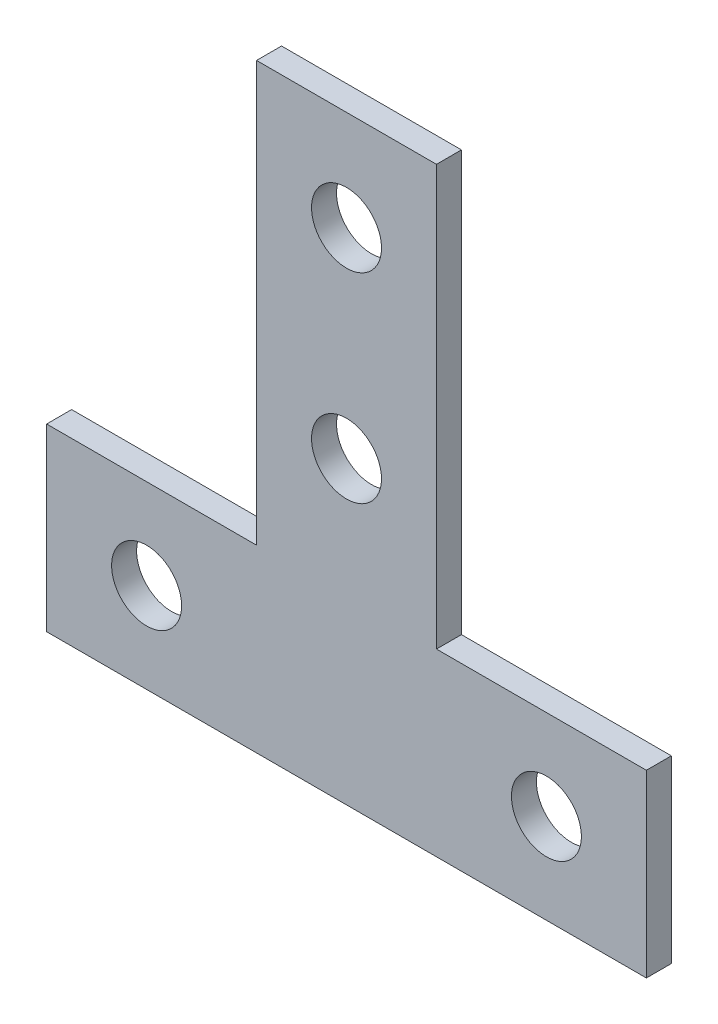
ISO-10303-21;
HEADER;
FILE_DESCRIPTION(('STEP AP214'),'2;1');
FILE_NAME('part.step','',(''),(''),'','','');
FILE_SCHEMA(('AUTOMOTIVE_DESIGN { 1 0 10303 214 1 1 1 1 }'));
ENDSEC;
DATA;
#1=APPLICATION_CONTEXT('core data for automotive mechanical design processes');
#2=APPLICATION_PROTOCOL_DEFINITION('international standard','automotive_design',2000,#1);
#3=PRODUCT_CONTEXT('',#1,'mechanical');
#4=PRODUCT('Part','Part','',(#3));
#5=PRODUCT_RELATED_PRODUCT_CATEGORY('part','',(#4));
#6=PRODUCT_DEFINITION_FORMATION('','',#4);
#7=PRODUCT_DEFINITION_CONTEXT('part definition',#1,'design');
#8=PRODUCT_DEFINITION('design','',#6,#7);
#9=PRODUCT_DEFINITION_SHAPE('','',#8);
#10=(LENGTH_UNIT() NAMED_UNIT(*) SI_UNIT(.MILLI.,.METRE.));
#11=(NAMED_UNIT(*) PLANE_ANGLE_UNIT() SI_UNIT($,.RADIAN.));
#12=(NAMED_UNIT(*) SI_UNIT($,.STERADIAN.) SOLID_ANGLE_UNIT());
#13=UNCERTAINTY_MEASURE_WITH_UNIT(LENGTH_MEASURE(1.E-05),#10,'distance_accuracy_value','');
#14=(GEOMETRIC_REPRESENTATION_CONTEXT(3) GLOBAL_UNCERTAINTY_ASSIGNED_CONTEXT((#13)) GLOBAL_UNIT_ASSIGNED_CONTEXT((#10,
#11,#12)) REPRESENTATION_CONTEXT('',''));
#15=CARTESIAN_POINT('',(0.,0.,0.));
#16=DIRECTION('',(0.,0.,1.));
#17=DIRECTION('',(1.,0.,0.));
#18=AXIS2_PLACEMENT_3D('',#15,#16,#17);
#19=CARTESIAN_POINT('',(0.,0.,2.5));
#20=DIRECTION('',(0.,0.,1.));
#21=DIRECTION('',(1.,0.,0.));
#22=AXIS2_PLACEMENT_3D('',#19,#20,#21);
#23=PLANE('',#22);
#24=CARTESIAN_POINT('',(-20.,9.,2.5));
#25=DIRECTION('',(0.,0.,1.));
#26=DIRECTION('',(1.,0.,0.));
#27=AXIS2_PLACEMENT_3D('',#24,#25,#26);
#28=CIRCLE('',#27,3.5);
#29=CARTESIAN_POINT('',(-16.5,9.,2.5));
#30=VERTEX_POINT('',#29);
#31=EDGE_CURVE('E189',#30,#30,#28,.T.);
#32=ORIENTED_EDGE('',*,*,#31,.F.);
#33=EDGE_LOOP('',(#32));
#34=FACE_BOUND('',#33,.T.);
#35=CARTESIAN_POINT('',(0.,50.,2.5));
#36=DIRECTION('',(0.,0.,1.));
#37=DIRECTION('',(1.,0.,0.));
#38=AXIS2_PLACEMENT_3D('',#35,#36,#37);
#39=CIRCLE('',#38,3.5);
#40=CARTESIAN_POINT('',(3.5,50.,2.5));
#41=VERTEX_POINT('',#40);
#42=EDGE_CURVE('E135',#41,#41,#39,.T.);
#43=ORIENTED_EDGE('',*,*,#42,.F.);
#44=EDGE_LOOP('',(#43));
#45=FACE_BOUND('',#44,.T.);
#46=DIRECTION('',(0.,1.,0.));
#47=VECTOR('',#46,1.);
#48=CARTESIAN_POINT('',(30.,18.,2.5));
#49=LINE('',#48,#47);
#50=CARTESIAN_POINT('',(30.,0.,2.5));
#51=VERTEX_POINT('',#50);
#52=CARTESIAN_POINT('',(30.,18.,2.5));
#53=VERTEX_POINT('',#52);
#54=EDGE_CURVE('E146',#51,#53,#49,.T.);
#55=ORIENTED_EDGE('',*,*,#54,.T.);
#56=DIRECTION('',(-1.,0.,0.));
#57=VECTOR('',#56,1.);
#58=CARTESIAN_POINT('',(9.,18.,2.5));
#59=LINE('',#58,#57);
#60=CARTESIAN_POINT('',(9.,18.,2.5));
#61=VERTEX_POINT('',#60);
#62=EDGE_CURVE('E94',#53,#61,#59,.T.);
#63=ORIENTED_EDGE('',*,*,#62,.T.);
#64=DIRECTION('',(0.,1.,0.));
#65=VECTOR('',#64,1.);
#66=CARTESIAN_POINT('',(9.,60.,2.5));
#67=LINE('',#66,#65);
#68=CARTESIAN_POINT('',(9.,60.,2.5));
#69=VERTEX_POINT('',#68);
#70=EDGE_CURVE('E161',#61,#69,#67,.T.);
#71=ORIENTED_EDGE('',*,*,#70,.T.);
#72=DIRECTION('',(-1.,0.,0.));
#73=VECTOR('',#72,1.);
#74=CARTESIAN_POINT('',(-9.,60.,2.5));
#75=LINE('',#74,#73);
#76=CARTESIAN_POINT('',(-9.,60.,2.5));
#77=VERTEX_POINT('',#76);
#78=EDGE_CURVE('E174',#69,#77,#75,.T.);
#79=ORIENTED_EDGE('',*,*,#78,.T.);
#80=DIRECTION('',(0.,-1.,0.));
#81=VECTOR('',#80,1.);
#82=CARTESIAN_POINT('',(-9.,18.,2.5));
#83=LINE('',#82,#81);
#84=CARTESIAN_POINT('',(-9.,18.,2.5));
#85=VERTEX_POINT('',#84);
#86=EDGE_CURVE('E113',#77,#85,#83,.T.);
#87=ORIENTED_EDGE('',*,*,#86,.T.);
#88=DIRECTION('',(-1.,0.,0.));
#89=VECTOR('',#88,1.);
#90=CARTESIAN_POINT('',(-30.,18.,2.5));
#91=LINE('',#90,#89);
#92=CARTESIAN_POINT('',(-30.,18.,2.5));
#93=VERTEX_POINT('',#92);
#94=EDGE_CURVE('E107',#85,#93,#91,.T.);
#95=ORIENTED_EDGE('',*,*,#94,.T.);
#96=DIRECTION('',(0.,-1.,0.));
#97=VECTOR('',#96,1.);
#98=CARTESIAN_POINT('',(-30.,0.,2.5));
#99=LINE('',#98,#97);
#100=CARTESIAN_POINT('',(-30.,0.,2.5));
#101=VERTEX_POINT('',#100);
#102=EDGE_CURVE('E111',#93,#101,#99,.T.);
#103=ORIENTED_EDGE('',*,*,#102,.T.);
#104=DIRECTION('',(1.,0.,0.));
#105=VECTOR('',#104,1.);
#106=CARTESIAN_POINT('',(-30.,0.,2.5));
#107=LINE('',#106,#105);
#108=EDGE_CURVE('E51',#101,#51,#107,.T.);
#109=ORIENTED_EDGE('',*,*,#108,.T.);
#110=EDGE_LOOP('',(#55,#63,#71,#79,#87,#95,#103,#109));
#111=FACE_BOUND('',#110,.T.);
#112=CARTESIAN_POINT('',(0.,30.,2.5));
#113=DIRECTION('',(0.,0.,1.));
#114=DIRECTION('',(1.,0.,0.));
#115=AXIS2_PLACEMENT_3D('',#112,#113,#114);
#116=CIRCLE('',#115,3.5);
#117=CARTESIAN_POINT('',(3.5,30.,2.5));
#118=VERTEX_POINT('',#117);
#119=EDGE_CURVE('E183',#118,#118,#116,.T.);
#120=ORIENTED_EDGE('',*,*,#119,.F.);
#121=EDGE_LOOP('',(#120));
#122=FACE_BOUND('',#121,.T.);
#123=CARTESIAN_POINT('',(20.,9.,2.5));
#124=DIRECTION('',(0.,0.,1.));
#125=DIRECTION('',(1.,0.,0.));
#126=AXIS2_PLACEMENT_3D('',#123,#124,#125);
#127=CIRCLE('',#126,3.5);
#128=CARTESIAN_POINT('',(23.5,9.,2.5));
#129=VERTEX_POINT('',#128);
#130=EDGE_CURVE('E195',#129,#129,#127,.T.);
#131=ORIENTED_EDGE('',*,*,#130,.F.);
#132=EDGE_LOOP('',(#131));
#133=FACE_BOUND('',#132,.T.);
#134=ADVANCED_FACE('F34',(#34,#45,#111,#122,#133),#23,.T.);
#135=CARTESIAN_POINT('',(0.,0.,0.));
#136=DIRECTION('',(0.,0.,1.));
#137=DIRECTION('',(1.,0.,0.));
#138=AXIS2_PLACEMENT_3D('',#135,#136,#137);
#139=PLANE('',#138);
#140=DIRECTION('',(0.,1.,0.));
#141=VECTOR('',#140,1.);
#142=CARTESIAN_POINT('',(30.,18.,0.));
#143=LINE('',#142,#141);
#144=CARTESIAN_POINT('',(30.,0.,0.));
#145=VERTEX_POINT('',#144);
#146=CARTESIAN_POINT('',(30.,18.,0.));
#147=VERTEX_POINT('',#146);
#148=EDGE_CURVE('E131',#145,#147,#143,.T.);
#149=ORIENTED_EDGE('',*,*,#148,.F.);
#150=DIRECTION('',(1.,0.,0.));
#151=VECTOR('',#150,1.);
#152=CARTESIAN_POINT('',(-30.,0.,0.));
#153=LINE('',#152,#151);
#154=CARTESIAN_POINT('',(-30.,0.,0.));
#155=VERTEX_POINT('',#154);
#156=EDGE_CURVE('E86',#155,#145,#153,.T.);
#157=ORIENTED_EDGE('',*,*,#156,.F.);
#158=DIRECTION('',(0.,-1.,0.));
#159=VECTOR('',#158,1.);
#160=CARTESIAN_POINT('',(-30.,0.,0.));
#161=LINE('',#160,#159);
#162=CARTESIAN_POINT('',(-30.,18.,0.));
#163=VERTEX_POINT('',#162);
#164=EDGE_CURVE('E80',#163,#155,#161,.T.);
#165=ORIENTED_EDGE('',*,*,#164,.F.);
#166=DIRECTION('',(-1.,0.,0.));
#167=VECTOR('',#166,1.);
#168=CARTESIAN_POINT('',(-30.,18.,0.));
#169=LINE('',#168,#167);
#170=CARTESIAN_POINT('',(-9.,18.,0.));
#171=VERTEX_POINT('',#170);
#172=EDGE_CURVE('E121',#171,#163,#169,.T.);
#173=ORIENTED_EDGE('',*,*,#172,.F.);
#174=DIRECTION('',(0.,-1.,0.));
#175=VECTOR('',#174,1.);
#176=CARTESIAN_POINT('',(-9.,18.,0.));
#177=LINE('',#176,#175);
#178=CARTESIAN_POINT('',(-9.,60.,0.));
#179=VERTEX_POINT('',#178);
#180=EDGE_CURVE('E141',#179,#171,#177,.T.);
#181=ORIENTED_EDGE('',*,*,#180,.F.);
#182=DIRECTION('',(-1.,0.,0.));
#183=VECTOR('',#182,1.);
#184=CARTESIAN_POINT('',(-9.,60.,0.));
#185=LINE('',#184,#183);
#186=CARTESIAN_POINT('',(9.,60.,0.));
#187=VERTEX_POINT('',#186);
#188=EDGE_CURVE('E139',#187,#179,#185,.T.);
#189=ORIENTED_EDGE('',*,*,#188,.F.);
#190=DIRECTION('',(0.,1.,0.));
#191=VECTOR('',#190,1.);
#192=CARTESIAN_POINT('',(9.,60.,0.));
#193=LINE('',#192,#191);
#194=CARTESIAN_POINT('',(9.,18.,0.));
#195=VERTEX_POINT('',#194);
#196=EDGE_CURVE('E137',#195,#187,#193,.T.);
#197=ORIENTED_EDGE('',*,*,#196,.F.);
#198=DIRECTION('',(-1.,0.,0.));
#199=VECTOR('',#198,1.);
#200=CARTESIAN_POINT('',(9.,18.,0.));
#201=LINE('',#200,#199);
#202=EDGE_CURVE('E134',#147,#195,#201,.T.);
#203=ORIENTED_EDGE('',*,*,#202,.F.);
#204=EDGE_LOOP('',(#149,#157,#165,#173,#181,#189,#197,#203));
#205=FACE_BOUND('',#204,.T.);
#206=CARTESIAN_POINT('',(0.,50.,0.));
#207=DIRECTION('',(0.,0.,1.));
#208=DIRECTION('',(1.,0.,0.));
#209=AXIS2_PLACEMENT_3D('',#206,#207,#208);
#210=CIRCLE('',#209,3.5);
#211=CARTESIAN_POINT('',(3.5,50.,0.));
#212=VERTEX_POINT('',#211);
#213=EDGE_CURVE('E180',#212,#212,#210,.T.);
#214=ORIENTED_EDGE('',*,*,#213,.T.);
#215=EDGE_LOOP('',(#214));
#216=FACE_BOUND('',#215,.T.);
#217=CARTESIAN_POINT('',(0.,30.,0.));
#218=DIRECTION('',(0.,0.,1.));
#219=DIRECTION('',(1.,0.,0.));
#220=AXIS2_PLACEMENT_3D('',#217,#218,#219);
#221=CIRCLE('',#220,3.5);
#222=CARTESIAN_POINT('',(3.5,30.,0.));
#223=VERTEX_POINT('',#222);
#224=EDGE_CURVE('E186',#223,#223,#221,.T.);
#225=ORIENTED_EDGE('',*,*,#224,.T.);
#226=EDGE_LOOP('',(#225));
#227=FACE_BOUND('',#226,.T.);
#228=CARTESIAN_POINT('',(-20.,9.,0.));
#229=DIRECTION('',(0.,0.,1.));
#230=DIRECTION('',(1.,0.,0.));
#231=AXIS2_PLACEMENT_3D('',#228,#229,#230);
#232=CIRCLE('',#231,3.5);
#233=CARTESIAN_POINT('',(-16.5,9.,0.));
#234=VERTEX_POINT('',#233);
#235=EDGE_CURVE('E192',#234,#234,#232,.T.);
#236=ORIENTED_EDGE('',*,*,#235,.T.);
#237=EDGE_LOOP('',(#236));
#238=FACE_BOUND('',#237,.T.);
#239=CARTESIAN_POINT('',(20.,9.,0.));
#240=DIRECTION('',(0.,0.,1.));
#241=DIRECTION('',(1.,0.,0.));
#242=AXIS2_PLACEMENT_3D('',#239,#240,#241);
#243=CIRCLE('',#242,3.5);
#244=CARTESIAN_POINT('',(23.5,9.,0.));
#245=VERTEX_POINT('',#244);
#246=EDGE_CURVE('E198',#245,#245,#243,.T.);
#247=ORIENTED_EDGE('',*,*,#246,.T.);
#248=EDGE_LOOP('',(#247));
#249=FACE_BOUND('',#248,.T.);
#250=ADVANCED_FACE('F165',(#205,#216,#227,#238,#249),#139,.F.);
#251=CARTESIAN_POINT('',(30.,18.,2.5));
#252=DIRECTION('',(-1.,0.,0.));
#253=DIRECTION('',(0.,0.,1.));
#254=AXIS2_PLACEMENT_3D('',#251,#252,#253);
#255=PLANE('',#254);
#256=ORIENTED_EDGE('',*,*,#148,.T.);
#257=DIRECTION('',(0.,0.,-1.));
#258=VECTOR('',#257,1.);
#259=CARTESIAN_POINT('',(30.,18.,2.5));
#260=LINE('',#259,#258);
#261=EDGE_CURVE('E11',#53,#147,#260,.T.);
#262=ORIENTED_EDGE('',*,*,#261,.F.);
#263=ORIENTED_EDGE('',*,*,#54,.F.);
#264=DIRECTION('',(0.,0.,-1.));
#265=VECTOR('',#264,1.);
#266=CARTESIAN_POINT('',(30.,0.,2.5));
#267=LINE('',#266,#265);
#268=EDGE_CURVE('E127',#51,#145,#267,.T.);
#269=ORIENTED_EDGE('',*,*,#268,.T.);
#270=EDGE_LOOP('',(#256,#262,#263,#269));
#271=FACE_BOUND('',#270,.T.);
#272=ADVANCED_FACE('F36',(#271),#255,.F.);
#273=CARTESIAN_POINT('',(9.,18.,2.5));
#274=DIRECTION('',(0.,-1.,0.));
#275=DIRECTION('',(0.,0.,-1.));
#276=AXIS2_PLACEMENT_3D('',#273,#274,#275);
#277=PLANE('',#276);
#278=ORIENTED_EDGE('',*,*,#202,.T.);
#279=DIRECTION('',(0.,0.,-1.));
#280=VECTOR('',#279,1.);
#281=CARTESIAN_POINT('',(9.,18.,2.5));
#282=LINE('',#281,#280);
#283=EDGE_CURVE('E43',#61,#195,#282,.T.);
#284=ORIENTED_EDGE('',*,*,#283,.F.);
#285=ORIENTED_EDGE('',*,*,#62,.F.);
#286=ORIENTED_EDGE('',*,*,#261,.T.);
#287=EDGE_LOOP('',(#278,#284,#285,#286));
#288=FACE_BOUND('',#287,.T.);
#289=ADVANCED_FACE('F232',(#288),#277,.F.);
#290=CARTESIAN_POINT('',(9.,60.,2.5));
#291=DIRECTION('',(-1.,0.,0.));
#292=DIRECTION('',(0.,-1.,0.));
#293=AXIS2_PLACEMENT_3D('',#290,#291,#292);
#294=PLANE('',#293);
#295=ORIENTED_EDGE('',*,*,#196,.T.);
#296=DIRECTION('',(0.,0.,-1.));
#297=VECTOR('',#296,1.);
#298=CARTESIAN_POINT('',(9.,60.,2.5));
#299=LINE('',#298,#297);
#300=EDGE_CURVE('E153',#69,#187,#299,.T.);
#301=ORIENTED_EDGE('',*,*,#300,.F.);
#302=ORIENTED_EDGE('',*,*,#70,.F.);
#303=ORIENTED_EDGE('',*,*,#283,.T.);
#304=EDGE_LOOP('',(#295,#301,#302,#303));
#305=FACE_BOUND('',#304,.T.);
#306=ADVANCED_FACE('F159',(#305),#294,.F.);
#307=CARTESIAN_POINT('',(-9.,60.,2.5));
#308=DIRECTION('',(0.,-1.,0.));
#309=DIRECTION('',(0.,0.,-1.));
#310=AXIS2_PLACEMENT_3D('',#307,#308,#309);
#311=PLANE('',#310);
#312=ORIENTED_EDGE('',*,*,#188,.T.);
#313=DIRECTION('',(0.,0.,-1.));
#314=VECTOR('',#313,1.);
#315=CARTESIAN_POINT('',(-9.,60.,2.5));
#316=LINE('',#315,#314);
#317=EDGE_CURVE('E150',#77,#179,#316,.T.);
#318=ORIENTED_EDGE('',*,*,#317,.F.);
#319=ORIENTED_EDGE('',*,*,#78,.F.);
#320=ORIENTED_EDGE('',*,*,#300,.T.);
#321=EDGE_LOOP('',(#312,#318,#319,#320));
#322=FACE_BOUND('',#321,.T.);
#323=ADVANCED_FACE('F170',(#322),#311,.F.);
#324=CARTESIAN_POINT('',(-9.,18.,2.5));
#325=DIRECTION('',(1.,0.,0.));
#326=DIRECTION('',(0.,1.,0.));
#327=AXIS2_PLACEMENT_3D('',#324,#325,#326);
#328=PLANE('',#327);
#329=ORIENTED_EDGE('',*,*,#180,.T.);
#330=DIRECTION('',(0.,0.,-1.));
#331=VECTOR('',#330,1.);
#332=CARTESIAN_POINT('',(-9.,18.,2.5));
#333=LINE('',#332,#331);
#334=EDGE_CURVE('E122',#85,#171,#333,.T.);
#335=ORIENTED_EDGE('',*,*,#334,.F.);
#336=ORIENTED_EDGE('',*,*,#86,.F.);
#337=ORIENTED_EDGE('',*,*,#317,.T.);
#338=EDGE_LOOP('',(#329,#335,#336,#337));
#339=FACE_BOUND('',#338,.T.);
#340=ADVANCED_FACE('F173',(#339),#328,.F.);
#341=CARTESIAN_POINT('',(-30.,18.,2.5));
#342=DIRECTION('',(0.,-1.,0.));
#343=DIRECTION('',(1.,0.,0.));
#344=AXIS2_PLACEMENT_3D('',#341,#342,#343);
#345=PLANE('',#344);
#346=ORIENTED_EDGE('',*,*,#172,.T.);
#347=DIRECTION('',(0.,0.,-1.));
#348=VECTOR('',#347,1.);
#349=CARTESIAN_POINT('',(-30.,18.,2.5));
#350=LINE('',#349,#348);
#351=EDGE_CURVE('E118',#93,#163,#350,.T.);
#352=ORIENTED_EDGE('',*,*,#351,.F.);
#353=ORIENTED_EDGE('',*,*,#94,.F.);
#354=ORIENTED_EDGE('',*,*,#334,.T.);
#355=EDGE_LOOP('',(#346,#352,#353,#354));
#356=FACE_BOUND('',#355,.T.);
#357=ADVANCED_FACE('F119',(#356),#345,.F.);
#358=CARTESIAN_POINT('',(-30.,0.,2.5));
#359=DIRECTION('',(1.,0.,0.));
#360=DIRECTION('',(0.,0.,-1.));
#361=AXIS2_PLACEMENT_3D('',#358,#359,#360);
#362=PLANE('',#361);
#363=ORIENTED_EDGE('',*,*,#164,.T.);
#364=DIRECTION('',(0.,0.,-1.));
#365=VECTOR('',#364,1.);
#366=CARTESIAN_POINT('',(-30.,0.,2.5));
#367=LINE('',#366,#365);
#368=EDGE_CURVE('E123',#101,#155,#367,.T.);
#369=ORIENTED_EDGE('',*,*,#368,.F.);
#370=ORIENTED_EDGE('',*,*,#102,.F.);
#371=ORIENTED_EDGE('',*,*,#351,.T.);
#372=EDGE_LOOP('',(#363,#369,#370,#371));
#373=FACE_BOUND('',#372,.T.);
#374=ADVANCED_FACE('F125',(#373),#362,.F.);
#375=CARTESIAN_POINT('',(-30.,0.,2.5));
#376=DIRECTION('',(0.,1.,0.));
#377=DIRECTION('',(-1.,0.,0.));
#378=AXIS2_PLACEMENT_3D('',#375,#376,#377);
#379=PLANE('',#378);
#380=ORIENTED_EDGE('',*,*,#156,.T.);
#381=ORIENTED_EDGE('',*,*,#268,.F.);
#382=ORIENTED_EDGE('',*,*,#108,.F.);
#383=ORIENTED_EDGE('',*,*,#368,.T.);
#384=EDGE_LOOP('',(#380,#381,#382,#383));
#385=FACE_BOUND('',#384,.T.);
#386=ADVANCED_FACE('F220',(#385),#379,.F.);
#387=CARTESIAN_POINT('',(0.,50.,2.5));
#388=DIRECTION('',(0.,0.,-1.));
#389=DIRECTION('',(-1.,0.,0.));
#390=AXIS2_PLACEMENT_3D('',#387,#388,#389);
#391=CYLINDRICAL_SURFACE('',#390,3.5);
#392=ORIENTED_EDGE('',*,*,#42,.T.);
#393=EDGE_LOOP('',(#392));
#394=FACE_BOUND('',#393,.T.);
#395=ORIENTED_EDGE('',*,*,#213,.F.);
#396=EDGE_LOOP('',(#395));
#397=FACE_BOUND('',#396,.T.);
#398=ADVANCED_FACE('F217',(#394,#397),#391,.F.);
#399=CARTESIAN_POINT('',(0.,30.,2.5));
#400=DIRECTION('',(0.,0.,-1.));
#401=DIRECTION('',(-1.,0.,0.));
#402=AXIS2_PLACEMENT_3D('',#399,#400,#401);
#403=CYLINDRICAL_SURFACE('',#402,3.5);
#404=ORIENTED_EDGE('',*,*,#119,.T.);
#405=EDGE_LOOP('',(#404));
#406=FACE_BOUND('',#405,.T.);
#407=ORIENTED_EDGE('',*,*,#224,.F.);
#408=EDGE_LOOP('',(#407));
#409=FACE_BOUND('',#408,.T.);
#410=ADVANCED_FACE('F296',(#406,#409),#403,.F.);
#411=CARTESIAN_POINT('',(-20.,9.,2.5));
#412=DIRECTION('',(0.,0.,-1.));
#413=DIRECTION('',(-1.,0.,0.));
#414=AXIS2_PLACEMENT_3D('',#411,#412,#413);
#415=CYLINDRICAL_SURFACE('',#414,3.5);
#416=ORIENTED_EDGE('',*,*,#31,.T.);
#417=EDGE_LOOP('',(#416));
#418=FACE_BOUND('',#417,.T.);
#419=ORIENTED_EDGE('',*,*,#235,.F.);
#420=EDGE_LOOP('',(#419));
#421=FACE_BOUND('',#420,.T.);
#422=ADVANCED_FACE('F304',(#418,#421),#415,.F.);
#423=CARTESIAN_POINT('',(20.,9.,2.5));
#424=DIRECTION('',(0.,0.,-1.));
#425=DIRECTION('',(-1.,0.,0.));
#426=AXIS2_PLACEMENT_3D('',#423,#424,#425);
#427=CYLINDRICAL_SURFACE('',#426,3.5);
#428=ORIENTED_EDGE('',*,*,#130,.T.);
#429=EDGE_LOOP('',(#428));
#430=FACE_BOUND('',#429,.T.);
#431=ORIENTED_EDGE('',*,*,#246,.F.);
#432=EDGE_LOOP('',(#431));
#433=FACE_BOUND('',#432,.T.);
#434=ADVANCED_FACE('F204',(#430,#433),#427,.F.);
#435=CLOSED_SHELL('',(#134,#250,#272,#289,#306,#323,#340,#357,#374,#386,#398,#410,#422,#434));
#436=MANIFOLD_SOLID_BREP('B2',#435);
#437=ADVANCED_BREP_SHAPE_REPRESENTATION('',(#18,#436),#14);
#438=SHAPE_DEFINITION_REPRESENTATION(#9,#437);
ENDSEC;
END-ISO-10303-21;
